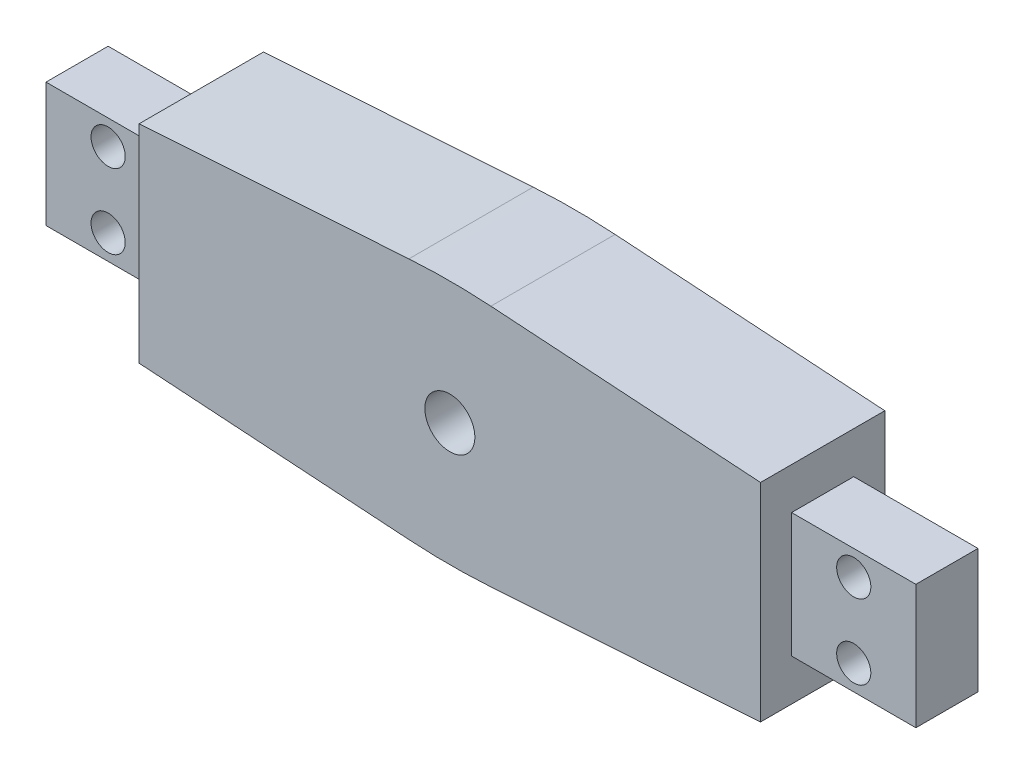
ISO-10303-21;
HEADER;
FILE_DESCRIPTION(('STEP AP214'),'2;1');
FILE_NAME('part.step','',(''),(''),'','','');
FILE_SCHEMA(('AUTOMOTIVE_DESIGN { 1 0 10303 214 1 1 1 1 }'));
ENDSEC;
DATA;
#1=APPLICATION_CONTEXT('core data for automotive mechanical design processes');
#2=APPLICATION_PROTOCOL_DEFINITION('international standard','automotive_design',2000,#1);
#3=PRODUCT_CONTEXT('',#1,'mechanical');
#4=PRODUCT('Part','Part','',(#3));
#5=PRODUCT_RELATED_PRODUCT_CATEGORY('part','',(#4));
#6=PRODUCT_DEFINITION_FORMATION('','',#4);
#7=PRODUCT_DEFINITION_CONTEXT('part definition',#1,'design');
#8=PRODUCT_DEFINITION('design','',#6,#7);
#9=PRODUCT_DEFINITION_SHAPE('','',#8);
#10=(LENGTH_UNIT() NAMED_UNIT(*) SI_UNIT(.MILLI.,.METRE.));
#11=(NAMED_UNIT(*) PLANE_ANGLE_UNIT() SI_UNIT($,.RADIAN.));
#12=(NAMED_UNIT(*) SI_UNIT($,.STERADIAN.) SOLID_ANGLE_UNIT());
#13=UNCERTAINTY_MEASURE_WITH_UNIT(LENGTH_MEASURE(1.E-05),#10,'distance_accuracy_value','');
#14=(GEOMETRIC_REPRESENTATION_CONTEXT(3) GLOBAL_UNCERTAINTY_ASSIGNED_CONTEXT((#13)) GLOBAL_UNIT_ASSIGNED_CONTEXT((#10,
#11,#12)) REPRESENTATION_CONTEXT('',''));
#15=CARTESIAN_POINT('',(0.,0.,0.));
#16=DIRECTION('',(0.,0.,1.));
#17=DIRECTION('',(1.,0.,0.));
#18=AXIS2_PLACEMENT_3D('',#15,#16,#17);
#19=CARTESIAN_POINT('',(-50.,16.6956712271121,20.));
#20=DIRECTION('',(1.,0.,0.));
#21=DIRECTION('',(0.,0.,-1.));
#22=AXIS2_PLACEMENT_3D('',#19,#20,#21);
#23=PLANE('',#22);
#24=DIRECTION('',(0.,-1.,0.));
#25=VECTOR('',#24,1.);
#26=CARTESIAN_POINT('',(-50.,16.6956712271121,0.));
#27=LINE('',#26,#25);
#28=CARTESIAN_POINT('',(-50.,16.6956712271121,0.));
#29=VERTEX_POINT('',#28);
#30=CARTESIAN_POINT('',(-50.,-16.6956712271121,0.));
#31=VERTEX_POINT('',#30);
#32=EDGE_CURVE('E257',#29,#31,#27,.T.);
#33=ORIENTED_EDGE('',*,*,#32,.T.);
#34=DIRECTION('',(0.,0.,-1.));
#35=VECTOR('',#34,1.);
#36=CARTESIAN_POINT('',(-50.,-16.6956712271121,20.));
#37=LINE('',#36,#35);
#38=CARTESIAN_POINT('',(-50.,-16.6956712271121,20.));
#39=VERTEX_POINT('',#38);
#40=EDGE_CURVE('E270',#39,#31,#37,.T.);
#41=ORIENTED_EDGE('',*,*,#40,.F.);
#42=DIRECTION('',(0.,-1.,0.));
#43=VECTOR('',#42,1.);
#44=CARTESIAN_POINT('',(-50.,16.6956712271121,20.));
#45=LINE('',#44,#43);
#46=CARTESIAN_POINT('',(-50.,16.6956712271121,20.));
#47=VERTEX_POINT('',#46);
#48=EDGE_CURVE('E243',#47,#39,#45,.T.);
#49=ORIENTED_EDGE('',*,*,#48,.F.);
#50=DIRECTION('',(0.,0.,-1.));
#51=VECTOR('',#50,1.);
#52=CARTESIAN_POINT('',(-50.,16.6956712271121,20.));
#53=LINE('',#52,#51);
#54=EDGE_CURVE('E273',#47,#29,#53,.T.);
#55=ORIENTED_EDGE('',*,*,#54,.T.);
#56=EDGE_LOOP('',(#33,#41,#49,#55));
#57=FACE_BOUND('',#56,.T.);
#58=DIRECTION('',(0.,-1.,0.));
#59=VECTOR('',#58,1.);
#60=CARTESIAN_POINT('',(-50.,0.,5.));
#61=LINE('',#60,#59);
#62=CARTESIAN_POINT('',(-50.,10.,5.));
#63=VERTEX_POINT('',#62);
#64=CARTESIAN_POINT('',(-50.,-10.,5.));
#65=VERTEX_POINT('',#64);
#66=EDGE_CURVE('E66',#63,#65,#61,.T.);
#67=ORIENTED_EDGE('',*,*,#66,.F.);
#68=DIRECTION('',(0.,0.,-1.));
#69=VECTOR('',#68,1.);
#70=CARTESIAN_POINT('',(-50.,10.,0.));
#71=LINE('',#70,#69);
#72=CARTESIAN_POINT('',(-50.,10.,15.));
#73=VERTEX_POINT('',#72);
#74=EDGE_CURVE('E174',#73,#63,#71,.T.);
#75=ORIENTED_EDGE('',*,*,#74,.F.);
#76=DIRECTION('',(0.,-1.,0.));
#77=VECTOR('',#76,1.);
#78=CARTESIAN_POINT('',(-50.,0.,15.));
#79=LINE('',#78,#77);
#80=CARTESIAN_POINT('',(-50.,-10.,15.));
#81=VERTEX_POINT('',#80);
#82=EDGE_CURVE('E194',#73,#81,#79,.T.);
#83=ORIENTED_EDGE('',*,*,#82,.T.);
#84=DIRECTION('',(0.,0.,-1.));
#85=VECTOR('',#84,1.);
#86=CARTESIAN_POINT('',(-50.,-10.,0.));
#87=LINE('',#86,#85);
#88=EDGE_CURVE('E192',#81,#65,#87,.T.);
#89=ORIENTED_EDGE('',*,*,#88,.T.);
#90=EDGE_LOOP('',(#67,#75,#83,#89));
#91=FACE_BOUND('',#90,.T.);
#92=ADVANCED_FACE('F49',(#57,#91),#23,.F.);
#93=CARTESIAN_POINT('',(0.,0.,20.));
#94=DIRECTION('',(0.,0.,1.));
#95=DIRECTION('',(1.,0.,0.));
#96=AXIS2_PLACEMENT_3D('',#93,#94,#95);
#97=PLANE('',#96);
#98=DIRECTION('',(-0.997823409272585,0.0659427320304099,0.));
#99=VECTOR('',#98,1.);
#100=CARTESIAN_POINT('',(50.,16.6956712271121,20.));
#101=LINE('',#100,#99);
#102=CARTESIAN_POINT('',(50.,16.6956712271121,20.));
#103=VERTEX_POINT('',#102);
#104=CARTESIAN_POINT('',(6.594273203041,19.5642070663782,20.));
#105=VERTEX_POINT('',#104);
#106=EDGE_CURVE('E237',#103,#105,#101,.T.);
#107=ORIENTED_EDGE('',*,*,#106,.T.);
#108=CARTESIAN_POINT('',(0.,-80.2181338608804,20.));
#109=DIRECTION('',(0.,0.,1.));
#110=DIRECTION('',(1.,0.,0.));
#111=AXIS2_PLACEMENT_3D('',#108,#109,#110);
#112=CIRCLE('',#111,100.);
#113=CARTESIAN_POINT('',(-6.59427320304098,19.5642070663782,20.));
#114=VERTEX_POINT('',#113);
#115=EDGE_CURVE('E287',#105,#114,#112,.T.);
#116=ORIENTED_EDGE('',*,*,#115,.T.);
#117=DIRECTION('',(-0.997823409272585,-0.0659427320304099,0.));
#118=VECTOR('',#117,1.);
#119=CARTESIAN_POINT('',(-50.,16.6956712271121,20.));
#120=LINE('',#119,#118);
#121=EDGE_CURVE('E240',#114,#47,#120,.T.);
#122=ORIENTED_EDGE('',*,*,#121,.T.);
#123=ORIENTED_EDGE('',*,*,#48,.T.);
#124=DIRECTION('',(0.997823409272585,-0.0659427320304099,0.));
#125=VECTOR('',#124,1.);
#126=CARTESIAN_POINT('',(0.,-20.,20.));
#127=LINE('',#126,#125);
#128=CARTESIAN_POINT('',(-6.59427320304099,-19.5642070663782,20.));
#129=VERTEX_POINT('',#128);
#130=EDGE_CURVE('E245',#39,#129,#127,.T.);
#131=ORIENTED_EDGE('',*,*,#130,.T.);
#132=CARTESIAN_POINT('',(0.,80.2181338608804,20.));
#133=DIRECTION('',(0.,0.,1.));
#134=DIRECTION('',(1.,0.,0.));
#135=AXIS2_PLACEMENT_3D('',#132,#133,#134);
#136=CIRCLE('',#135,100.);
#137=CARTESIAN_POINT('',(6.59427320304099,-19.5642070663782,20.));
#138=VERTEX_POINT('',#137);
#139=EDGE_CURVE('E285',#129,#138,#136,.T.);
#140=ORIENTED_EDGE('',*,*,#139,.T.);
#141=DIRECTION('',(0.997823409272585,0.0659427320304099,0.));
#142=VECTOR('',#141,1.);
#143=CARTESIAN_POINT('',(0.,-20.,20.));
#144=LINE('',#143,#142);
#145=CARTESIAN_POINT('',(50.,-16.6956712271121,20.));
#146=VERTEX_POINT('',#145);
#147=EDGE_CURVE('E248',#138,#146,#144,.T.);
#148=ORIENTED_EDGE('',*,*,#147,.T.);
#149=DIRECTION('',(0.,1.,0.));
#150=VECTOR('',#149,1.);
#151=CARTESIAN_POINT('',(50.,16.6956712271121,20.));
#152=LINE('',#151,#150);
#153=EDGE_CURVE('E250',#146,#103,#152,.T.);
#154=ORIENTED_EDGE('',*,*,#153,.T.);
#155=EDGE_LOOP('',(#107,#116,#122,#123,#131,#140,#148,#154));
#156=FACE_BOUND('',#155,.T.);
#157=CARTESIAN_POINT('',(0.,0.,20.));
#158=DIRECTION('',(0.,0.,1.));
#159=DIRECTION('',(1.,0.,0.));
#160=AXIS2_PLACEMENT_3D('',#157,#158,#159);
#161=CIRCLE('',#160,4.025);
#162=CARTESIAN_POINT('',(4.025,0.,20.));
#163=VERTEX_POINT('',#162);
#164=EDGE_CURVE('E231',#163,#163,#161,.T.);
#165=ORIENTED_EDGE('',*,*,#164,.F.);
#166=EDGE_LOOP('',(#165));
#167=FACE_BOUND('',#166,.T.);
#168=ADVANCED_FACE('F321',(#156,#167),#97,.T.);
#169=CARTESIAN_POINT('',(0.,0.,0.));
#170=DIRECTION('',(0.,0.,1.));
#171=DIRECTION('',(1.,0.,0.));
#172=AXIS2_PLACEMENT_3D('',#169,#170,#171);
#173=PLANE('',#172);
#174=DIRECTION('',(-0.997823409272585,-0.0659427320304099,0.));
#175=VECTOR('',#174,1.);
#176=CARTESIAN_POINT('',(-50.,16.6956712271121,0.));
#177=LINE('',#176,#175);
#178=CARTESIAN_POINT('',(-6.59427320304098,19.5642070663782,0.));
#179=VERTEX_POINT('',#178);
#180=EDGE_CURVE('E255',#179,#29,#177,.T.);
#181=ORIENTED_EDGE('',*,*,#180,.F.);
#182=CARTESIAN_POINT('',(0.,-80.2181338608804,0.));
#183=DIRECTION('',(0.,0.,1.));
#184=DIRECTION('',(1.,0.,0.));
#185=AXIS2_PLACEMENT_3D('',#182,#183,#184);
#186=CIRCLE('',#185,100.);
#187=CARTESIAN_POINT('',(6.594273203041,19.5642070663782,0.));
#188=VERTEX_POINT('',#187);
#189=EDGE_CURVE('E281',#179,#188,#186,.F.);
#190=ORIENTED_EDGE('',*,*,#189,.T.);
#191=DIRECTION('',(-0.997823409272585,0.0659427320304099,0.));
#192=VECTOR('',#191,1.);
#193=CARTESIAN_POINT('',(50.,16.6956712271121,0.));
#194=LINE('',#193,#192);
#195=CARTESIAN_POINT('',(50.,16.6956712271121,0.));
#196=VERTEX_POINT('',#195);
#197=EDGE_CURVE('E234',#196,#188,#194,.T.);
#198=ORIENTED_EDGE('',*,*,#197,.F.);
#199=DIRECTION('',(0.,1.,0.));
#200=VECTOR('',#199,1.);
#201=CARTESIAN_POINT('',(50.,16.6956712271121,0.));
#202=LINE('',#201,#200);
#203=CARTESIAN_POINT('',(50.,-16.6956712271121,0.));
#204=VERTEX_POINT('',#203);
#205=EDGE_CURVE('E241',#204,#196,#202,.T.);
#206=ORIENTED_EDGE('',*,*,#205,.F.);
#207=DIRECTION('',(0.997823409272585,0.0659427320304099,0.));
#208=VECTOR('',#207,1.);
#209=CARTESIAN_POINT('',(0.,-20.,0.));
#210=LINE('',#209,#208);
#211=CARTESIAN_POINT('',(6.59427320304099,-19.5642070663782,0.));
#212=VERTEX_POINT('',#211);
#213=EDGE_CURVE('E262',#212,#204,#210,.T.);
#214=ORIENTED_EDGE('',*,*,#213,.F.);
#215=CARTESIAN_POINT('',(0.,80.2181338608804,0.));
#216=DIRECTION('',(0.,0.,1.));
#217=DIRECTION('',(1.,0.,0.));
#218=AXIS2_PLACEMENT_3D('',#215,#216,#217);
#219=CIRCLE('',#218,100.);
#220=CARTESIAN_POINT('',(-6.59427320304099,-19.5642070663782,0.));
#221=VERTEX_POINT('',#220);
#222=EDGE_CURVE('E279',#212,#221,#219,.F.);
#223=ORIENTED_EDGE('',*,*,#222,.T.);
#224=DIRECTION('',(0.997823409272585,-0.0659427320304099,0.));
#225=VECTOR('',#224,1.);
#226=CARTESIAN_POINT('',(0.,-20.,0.));
#227=LINE('',#226,#225);
#228=EDGE_CURVE('E259',#31,#221,#227,.T.);
#229=ORIENTED_EDGE('',*,*,#228,.F.);
#230=ORIENTED_EDGE('',*,*,#32,.F.);
#231=EDGE_LOOP('',(#181,#190,#198,#206,#214,#223,#229,#230));
#232=FACE_BOUND('',#231,.T.);
#233=CARTESIAN_POINT('',(0.,0.,0.));
#234=DIRECTION('',(0.,0.,1.));
#235=DIRECTION('',(1.,0.,0.));
#236=AXIS2_PLACEMENT_3D('',#233,#234,#235);
#237=CIRCLE('',#236,4.025);
#238=CARTESIAN_POINT('',(4.025,0.,0.));
#239=VERTEX_POINT('',#238);
#240=EDGE_CURVE('E230',#239,#239,#237,.T.);
#241=ORIENTED_EDGE('',*,*,#240,.T.);
#242=EDGE_LOOP('',(#241));
#243=FACE_BOUND('',#242,.T.);
#244=ADVANCED_FACE('F329',(#232,#243),#173,.F.);
#245=CARTESIAN_POINT('',(50.,16.6956712271121,20.));
#246=DIRECTION('',(-0.0659427320304099,-0.997823409272585,0.));
#247=DIRECTION('',(0.997823409272586,-0.0659427320304099,0.));
#248=AXIS2_PLACEMENT_3D('',#245,#246,#247);
#249=PLANE('',#248);
#250=ORIENTED_EDGE('',*,*,#197,.T.);
#251=DIRECTION('',(0.,0.,-1.));
#252=VECTOR('',#251,1.);
#253=CARTESIAN_POINT('',(6.59427320304098,19.5642070663782,20.));
#254=LINE('',#253,#252);
#255=EDGE_CURVE('E283',#188,#105,#254,.F.);
#256=ORIENTED_EDGE('',*,*,#255,.T.);
#257=ORIENTED_EDGE('',*,*,#106,.F.);
#258=DIRECTION('',(0.,0.,-1.));
#259=VECTOR('',#258,1.);
#260=CARTESIAN_POINT('',(50.,16.6956712271121,20.));
#261=LINE('',#260,#259);
#262=EDGE_CURVE('E252',#103,#196,#261,.T.);
#263=ORIENTED_EDGE('',*,*,#262,.T.);
#264=EDGE_LOOP('',(#250,#256,#257,#263));
#265=FACE_BOUND('',#264,.T.);
#266=ADVANCED_FACE('F340',(#265),#249,.F.);
#267=CARTESIAN_POINT('',(-50.,16.6956712271121,20.));
#268=DIRECTION('',(0.0659427320304099,-0.997823409272585,0.));
#269=DIRECTION('',(0.997823409272586,0.0659427320304099,0.));
#270=AXIS2_PLACEMENT_3D('',#267,#268,#269);
#271=PLANE('',#270);
#272=ORIENTED_EDGE('',*,*,#121,.F.);
#273=DIRECTION('',(0.,0.,-1.));
#274=VECTOR('',#273,1.);
#275=CARTESIAN_POINT('',(-6.59427320304097,19.5642070663782,20.));
#276=LINE('',#275,#274);
#277=EDGE_CURVE('E276',#114,#179,#276,.T.);
#278=ORIENTED_EDGE('',*,*,#277,.T.);
#279=ORIENTED_EDGE('',*,*,#180,.T.);
#280=ORIENTED_EDGE('',*,*,#54,.F.);
#281=EDGE_LOOP('',(#272,#278,#279,#280));
#282=FACE_BOUND('',#281,.T.);
#283=ADVANCED_FACE('F337',(#282),#271,.F.);
#284=CARTESIAN_POINT('',(0.,-20.,20.));
#285=DIRECTION('',(0.0659427320304099,0.997823409272585,0.));
#286=DIRECTION('',(-0.997823409272586,0.0659427320304099,0.));
#287=AXIS2_PLACEMENT_3D('',#284,#285,#286);
#288=PLANE('',#287);
#289=ORIENTED_EDGE('',*,*,#228,.T.);
#290=DIRECTION('',(0.,0.,-1.));
#291=VECTOR('',#290,1.);
#292=CARTESIAN_POINT('',(-6.59427320304099,-19.5642070663782,20.));
#293=LINE('',#292,#291);
#294=EDGE_CURVE('E11',#221,#129,#293,.F.);
#295=ORIENTED_EDGE('',*,*,#294,.T.);
#296=ORIENTED_EDGE('',*,*,#130,.F.);
#297=ORIENTED_EDGE('',*,*,#40,.T.);
#298=EDGE_LOOP('',(#289,#295,#296,#297));
#299=FACE_BOUND('',#298,.T.);
#300=ADVANCED_FACE('F335',(#299),#288,.F.);
#301=CARTESIAN_POINT('',(0.,-20.,20.));
#302=DIRECTION('',(-0.0659427320304099,0.997823409272585,0.));
#303=DIRECTION('',(-0.997823409272586,-0.0659427320304099,0.));
#304=AXIS2_PLACEMENT_3D('',#301,#302,#303);
#305=PLANE('',#304);
#306=ORIENTED_EDGE('',*,*,#147,.F.);
#307=DIRECTION('',(0.,0.,-1.));
#308=VECTOR('',#307,1.);
#309=CARTESIAN_POINT('',(6.59427320304099,-19.5642070663782,20.));
#310=LINE('',#309,#308);
#311=EDGE_CURVE('E58',#138,#212,#310,.T.);
#312=ORIENTED_EDGE('',*,*,#311,.T.);
#313=ORIENTED_EDGE('',*,*,#213,.T.);
#314=DIRECTION('',(0.,0.,-1.));
#315=VECTOR('',#314,1.);
#316=CARTESIAN_POINT('',(50.,-16.6956712271121,20.));
#317=LINE('',#316,#315);
#318=EDGE_CURVE('E267',#146,#204,#317,.T.);
#319=ORIENTED_EDGE('',*,*,#318,.F.);
#320=EDGE_LOOP('',(#306,#312,#313,#319));
#321=FACE_BOUND('',#320,.T.);
#322=ADVANCED_FACE('F377',(#321),#305,.F.);
#323=CARTESIAN_POINT('',(50.,16.6956712271121,20.));
#324=DIRECTION('',(-1.,0.,0.));
#325=DIRECTION('',(0.,0.,1.));
#326=AXIS2_PLACEMENT_3D('',#323,#324,#325);
#327=PLANE('',#326);
#328=DIRECTION('',(0.,0.,-1.));
#329=VECTOR('',#328,1.);
#330=CARTESIAN_POINT('',(50.,10.,0.));
#331=LINE('',#330,#329);
#332=CARTESIAN_POINT('',(50.,10.,15.));
#333=VERTEX_POINT('',#332);
#334=CARTESIAN_POINT('',(50.,10.,5.));
#335=VERTEX_POINT('',#334);
#336=EDGE_CURVE('E215',#333,#335,#331,.T.);
#337=ORIENTED_EDGE('',*,*,#336,.T.);
#338=DIRECTION('',(0.,-1.,0.));
#339=VECTOR('',#338,1.);
#340=CARTESIAN_POINT('',(50.,0.,5.));
#341=LINE('',#340,#339);
#342=CARTESIAN_POINT('',(50.,-10.,5.));
#343=VERTEX_POINT('',#342);
#344=EDGE_CURVE('E74',#335,#343,#341,.T.);
#345=ORIENTED_EDGE('',*,*,#344,.T.);
#346=DIRECTION('',(0.,0.,-1.));
#347=VECTOR('',#346,1.);
#348=CARTESIAN_POINT('',(50.,-10.,0.));
#349=LINE('',#348,#347);
#350=CARTESIAN_POINT('',(50.,-10.,15.));
#351=VERTEX_POINT('',#350);
#352=EDGE_CURVE('E206',#351,#343,#349,.T.);
#353=ORIENTED_EDGE('',*,*,#352,.F.);
#354=DIRECTION('',(0.,-1.,0.));
#355=VECTOR('',#354,1.);
#356=CARTESIAN_POINT('',(50.,0.,15.));
#357=LINE('',#356,#355);
#358=EDGE_CURVE('E218',#333,#351,#357,.T.);
#359=ORIENTED_EDGE('',*,*,#358,.F.);
#360=EDGE_LOOP('',(#337,#345,#353,#359));
#361=FACE_BOUND('',#360,.T.);
#362=ORIENTED_EDGE('',*,*,#205,.T.);
#363=ORIENTED_EDGE('',*,*,#262,.F.);
#364=ORIENTED_EDGE('',*,*,#153,.F.);
#365=ORIENTED_EDGE('',*,*,#318,.T.);
#366=EDGE_LOOP('',(#362,#363,#364,#365));
#367=FACE_BOUND('',#366,.T.);
#368=ADVANCED_FACE('F355',(#361,#367),#327,.F.);
#369=CARTESIAN_POINT('',(0.,0.,20.));
#370=DIRECTION('',(0.,0.,-1.));
#371=DIRECTION('',(-1.,0.,0.));
#372=AXIS2_PLACEMENT_3D('',#369,#370,#371);
#373=CYLINDRICAL_SURFACE('',#372,4.025);
#374=ORIENTED_EDGE('',*,*,#164,.T.);
#375=EDGE_LOOP('',(#374));
#376=FACE_BOUND('',#375,.T.);
#377=ORIENTED_EDGE('',*,*,#240,.F.);
#378=EDGE_LOOP('',(#377));
#379=FACE_BOUND('',#378,.T.);
#380=ADVANCED_FACE('F346',(#376,#379),#373,.F.);
#381=CARTESIAN_POINT('',(0.,-80.2181338608804,20.));
#382=DIRECTION('',(0.,0.,-1.));
#383=DIRECTION('',(-1.,0.,0.));
#384=AXIS2_PLACEMENT_3D('',#381,#382,#383);
#385=CYLINDRICAL_SURFACE('',#384,100.);
#386=ORIENTED_EDGE('',*,*,#115,.F.);
#387=ORIENTED_EDGE('',*,*,#255,.F.);
#388=ORIENTED_EDGE('',*,*,#189,.F.);
#389=ORIENTED_EDGE('',*,*,#277,.F.);
#390=EDGE_LOOP('',(#386,#387,#388,#389));
#391=FACE_BOUND('',#390,.T.);
#392=ADVANCED_FACE('F344',(#391),#385,.T.);
#393=CARTESIAN_POINT('',(0.,80.2181338608804,20.));
#394=DIRECTION('',(0.,0.,-1.));
#395=DIRECTION('',(-1.,0.,0.));
#396=AXIS2_PLACEMENT_3D('',#393,#394,#395);
#397=CYLINDRICAL_SURFACE('',#396,100.);
#398=ORIENTED_EDGE('',*,*,#139,.F.);
#399=ORIENTED_EDGE('',*,*,#294,.F.);
#400=ORIENTED_EDGE('',*,*,#222,.F.);
#401=ORIENTED_EDGE('',*,*,#311,.F.);
#402=EDGE_LOOP('',(#398,#399,#400,#401));
#403=FACE_BOUND('',#402,.T.);
#404=ADVANCED_FACE('F51',(#403),#397,.T.);
#405=CARTESIAN_POINT('',(70.,0.,5.));
#406=DIRECTION('',(0.,0.,-1.));
#407=DIRECTION('',(0.,1.,0.));
#408=AXIS2_PLACEMENT_3D('',#405,#406,#407);
#409=PLANE('',#408);
#410=CARTESIAN_POINT('',(60.,-6.,5.));
#411=DIRECTION('',(0.,0.,-1.));
#412=DIRECTION('',(0.,1.,0.));
#413=AXIS2_PLACEMENT_3D('',#410,#411,#412);
#414=CIRCLE('',#413,2.75000000000003);
#415=CARTESIAN_POINT('',(60.,-3.24999999999997,5.));
#416=VERTEX_POINT('',#415);
#417=EDGE_CURVE('E438',#416,#416,#414,.T.);
#418=ORIENTED_EDGE('',*,*,#417,.F.);
#419=EDGE_LOOP('',(#418));
#420=FACE_BOUND('',#419,.T.);
#421=CARTESIAN_POINT('',(60.,6.,5.));
#422=DIRECTION('',(0.,0.,-1.));
#423=DIRECTION('',(0.,1.,0.));
#424=AXIS2_PLACEMENT_3D('',#421,#422,#423);
#425=CIRCLE('',#424,2.75000000000003);
#426=CARTESIAN_POINT('',(60.,8.75000000000003,5.));
#427=VERTEX_POINT('',#426);
#428=EDGE_CURVE('E441',#427,#427,#425,.T.);
#429=ORIENTED_EDGE('',*,*,#428,.F.);
#430=EDGE_LOOP('',(#429));
#431=FACE_BOUND('',#430,.T.);
#432=ORIENTED_EDGE('',*,*,#344,.F.);
#433=DIRECTION('',(-1.,0.,0.));
#434=VECTOR('',#433,1.);
#435=CARTESIAN_POINT('',(70.,10.,5.));
#436=LINE('',#435,#434);
#437=CARTESIAN_POINT('',(70.,10.,5.));
#438=VERTEX_POINT('',#437);
#439=EDGE_CURVE('E228',#438,#335,#436,.T.);
#440=ORIENTED_EDGE('',*,*,#439,.F.);
#441=DIRECTION('',(0.,-1.,0.));
#442=VECTOR('',#441,1.);
#443=CARTESIAN_POINT('',(70.,0.,5.));
#444=LINE('',#443,#442);
#445=CARTESIAN_POINT('',(70.,-10.,5.));
#446=VERTEX_POINT('',#445);
#447=EDGE_CURVE('E202',#438,#446,#444,.T.);
#448=ORIENTED_EDGE('',*,*,#447,.T.);
#449=DIRECTION('',(-1.,0.,0.));
#450=VECTOR('',#449,1.);
#451=CARTESIAN_POINT('',(70.,-10.,5.));
#452=LINE('',#451,#450);
#453=EDGE_CURVE('E213',#446,#343,#452,.T.);
#454=ORIENTED_EDGE('',*,*,#453,.T.);
#455=EDGE_LOOP('',(#432,#440,#448,#454));
#456=FACE_BOUND('',#455,.T.);
#457=ADVANCED_FACE('F352',(#420,#431,#456),#409,.T.);
#458=CARTESIAN_POINT('',(70.,10.,0.));
#459=DIRECTION('',(0.,1.,0.));
#460=DIRECTION('',(0.,0.,1.));
#461=AXIS2_PLACEMENT_3D('',#458,#459,#460);
#462=PLANE('',#461);
#463=ORIENTED_EDGE('',*,*,#336,.F.);
#464=DIRECTION('',(-1.,0.,0.));
#465=VECTOR('',#464,1.);
#466=CARTESIAN_POINT('',(70.,10.,15.));
#467=LINE('',#466,#465);
#468=CARTESIAN_POINT('',(70.,10.,15.));
#469=VERTEX_POINT('',#468);
#470=EDGE_CURVE('E226',#469,#333,#467,.T.);
#471=ORIENTED_EDGE('',*,*,#470,.F.);
#472=DIRECTION('',(0.,0.,-1.));
#473=VECTOR('',#472,1.);
#474=CARTESIAN_POINT('',(70.,10.,0.));
#475=LINE('',#474,#473);
#476=EDGE_CURVE('E205',#469,#438,#475,.T.);
#477=ORIENTED_EDGE('',*,*,#476,.T.);
#478=ORIENTED_EDGE('',*,*,#439,.T.);
#479=EDGE_LOOP('',(#463,#471,#477,#478));
#480=FACE_BOUND('',#479,.T.);
#481=ADVANCED_FACE('F398',(#480),#462,.T.);
#482=CARTESIAN_POINT('',(70.,0.,15.));
#483=DIRECTION('',(0.,0.,-1.));
#484=DIRECTION('',(0.,1.,0.));
#485=AXIS2_PLACEMENT_3D('',#482,#483,#484);
#486=PLANE('',#485);
#487=CARTESIAN_POINT('',(60.,-6.,15.));
#488=DIRECTION('',(0.,0.,-1.));
#489=DIRECTION('',(0.,1.,0.));
#490=AXIS2_PLACEMENT_3D('',#487,#488,#489);
#491=CIRCLE('',#490,2.75000000000003);
#492=CARTESIAN_POINT('',(60.,-3.24999999999997,15.));
#493=VERTEX_POINT('',#492);
#494=EDGE_CURVE('E53',#493,#493,#491,.T.);
#495=ORIENTED_EDGE('',*,*,#494,.T.);
#496=EDGE_LOOP('',(#495));
#497=FACE_BOUND('',#496,.T.);
#498=CARTESIAN_POINT('',(60.,6.,15.));
#499=DIRECTION('',(0.,0.,-1.));
#500=DIRECTION('',(0.,1.,0.));
#501=AXIS2_PLACEMENT_3D('',#498,#499,#500);
#502=CIRCLE('',#501,2.75000000000003);
#503=CARTESIAN_POINT('',(60.,8.75000000000003,15.));
#504=VERTEX_POINT('',#503);
#505=EDGE_CURVE('E297',#504,#504,#502,.T.);
#506=ORIENTED_EDGE('',*,*,#505,.T.);
#507=EDGE_LOOP('',(#506));
#508=FACE_BOUND('',#507,.T.);
#509=ORIENTED_EDGE('',*,*,#358,.T.);
#510=DIRECTION('',(-1.,0.,0.));
#511=VECTOR('',#510,1.);
#512=CARTESIAN_POINT('',(70.,-10.,15.));
#513=LINE('',#512,#511);
#514=CARTESIAN_POINT('',(70.,-10.,15.));
#515=VERTEX_POINT('',#514);
#516=EDGE_CURVE('E223',#515,#351,#513,.T.);
#517=ORIENTED_EDGE('',*,*,#516,.F.);
#518=DIRECTION('',(0.,-1.,0.));
#519=VECTOR('',#518,1.);
#520=CARTESIAN_POINT('',(70.,0.,15.));
#521=LINE('',#520,#519);
#522=EDGE_CURVE('E209',#469,#515,#521,.T.);
#523=ORIENTED_EDGE('',*,*,#522,.F.);
#524=ORIENTED_EDGE('',*,*,#470,.T.);
#525=EDGE_LOOP('',(#509,#517,#523,#524));
#526=FACE_BOUND('',#525,.T.);
#527=ADVANCED_FACE('F304',(#497,#508,#526),#486,.F.);
#528=CARTESIAN_POINT('',(70.,-10.,0.));
#529=DIRECTION('',(0.,1.,0.));
#530=DIRECTION('',(0.,0.,1.));
#531=AXIS2_PLACEMENT_3D('',#528,#529,#530);
#532=PLANE('',#531);
#533=ORIENTED_EDGE('',*,*,#352,.T.);
#534=ORIENTED_EDGE('',*,*,#453,.F.);
#535=DIRECTION('',(0.,0.,-1.));
#536=VECTOR('',#535,1.);
#537=CARTESIAN_POINT('',(70.,-10.,0.));
#538=LINE('',#537,#536);
#539=EDGE_CURVE('E211',#515,#446,#538,.T.);
#540=ORIENTED_EDGE('',*,*,#539,.F.);
#541=ORIENTED_EDGE('',*,*,#516,.T.);
#542=EDGE_LOOP('',(#533,#534,#540,#541));
#543=FACE_BOUND('',#542,.T.);
#544=ADVANCED_FACE('F404',(#543),#532,.F.);
#545=CARTESIAN_POINT('',(70.,0.,0.));
#546=DIRECTION('',(1.,0.,0.));
#547=DIRECTION('',(0.,0.,-1.));
#548=AXIS2_PLACEMENT_3D('',#545,#546,#547);
#549=PLANE('',#548);
#550=ORIENTED_EDGE('',*,*,#447,.F.);
#551=ORIENTED_EDGE('',*,*,#476,.F.);
#552=ORIENTED_EDGE('',*,*,#522,.T.);
#553=ORIENTED_EDGE('',*,*,#539,.T.);
#554=EDGE_LOOP('',(#550,#551,#552,#553));
#555=FACE_BOUND('',#554,.T.);
#556=ADVANCED_FACE('F407',(#555),#549,.T.);
#557=CARTESIAN_POINT('',(-70.,0.,5.));
#558=DIRECTION('',(0.,0.,1.));
#559=DIRECTION('',(0.,-1.,0.));
#560=AXIS2_PLACEMENT_3D('',#557,#558,#559);
#561=PLANE('',#560);
#562=CARTESIAN_POINT('',(-60.,6.00000000000001,5.));
#563=DIRECTION('',(0.,0.,-1.));
#564=DIRECTION('',(0.,1.,0.));
#565=AXIS2_PLACEMENT_3D('',#562,#563,#564);
#566=CIRCLE('',#565,2.75000000000002);
#567=CARTESIAN_POINT('',(-60.,8.75000000000004,5.));
#568=VERTEX_POINT('',#567);
#569=EDGE_CURVE('E436',#568,#568,#566,.T.);
#570=ORIENTED_EDGE('',*,*,#569,.F.);
#571=EDGE_LOOP('',(#570));
#572=FACE_BOUND('',#571,.T.);
#573=CARTESIAN_POINT('',(-60.,-5.99999999999999,5.));
#574=DIRECTION('',(0.,0.,-1.));
#575=DIRECTION('',(0.,1.,0.));
#576=AXIS2_PLACEMENT_3D('',#573,#574,#575);
#577=CIRCLE('',#576,2.75000000000002);
#578=CARTESIAN_POINT('',(-60.,-3.24999999999996,5.));
#579=VERTEX_POINT('',#578);
#580=EDGE_CURVE('E295',#579,#579,#577,.T.);
#581=ORIENTED_EDGE('',*,*,#580,.F.);
#582=EDGE_LOOP('',(#581));
#583=FACE_BOUND('',#582,.T.);
#584=ORIENTED_EDGE('',*,*,#66,.T.);
#585=DIRECTION('',(1.,0.,0.));
#586=VECTOR('',#585,1.);
#587=CARTESIAN_POINT('',(-70.,-10.,5.));
#588=LINE('',#587,#586);
#589=CARTESIAN_POINT('',(-70.,-10.,5.));
#590=VERTEX_POINT('',#589);
#591=EDGE_CURVE('E176',#590,#65,#588,.T.);
#592=ORIENTED_EDGE('',*,*,#591,.F.);
#593=DIRECTION('',(0.,-1.,0.));
#594=VECTOR('',#593,1.);
#595=CARTESIAN_POINT('',(-70.,0.,5.));
#596=LINE('',#595,#594);
#597=CARTESIAN_POINT('',(-70.,10.,5.));
#598=VERTEX_POINT('',#597);
#599=EDGE_CURVE('E165',#598,#590,#596,.T.);
#600=ORIENTED_EDGE('',*,*,#599,.F.);
#601=DIRECTION('',(1.,0.,0.));
#602=VECTOR('',#601,1.);
#603=CARTESIAN_POINT('',(-70.,10.,5.));
#604=LINE('',#603,#602);
#605=EDGE_CURVE('E190',#598,#63,#604,.T.);
#606=ORIENTED_EDGE('',*,*,#605,.T.);
#607=EDGE_LOOP('',(#584,#592,#600,#606));
#608=FACE_BOUND('',#607,.T.);
#609=ADVANCED_FACE('F177',(#572,#583,#608),#561,.F.);
#610=CARTESIAN_POINT('',(-70.,-10.,0.));
#611=DIRECTION('',(0.,-1.,0.));
#612=DIRECTION('',(0.,0.,-1.));
#613=AXIS2_PLACEMENT_3D('',#610,#611,#612);
#614=PLANE('',#613);
#615=ORIENTED_EDGE('',*,*,#88,.F.);
#616=DIRECTION('',(1.,0.,0.));
#617=VECTOR('',#616,1.);
#618=CARTESIAN_POINT('',(-70.,-10.,15.));
#619=LINE('',#618,#617);
#620=CARTESIAN_POINT('',(-70.,-10.,15.));
#621=VERTEX_POINT('',#620);
#622=EDGE_CURVE('E181',#621,#81,#619,.T.);
#623=ORIENTED_EDGE('',*,*,#622,.F.);
#624=DIRECTION('',(0.,0.,-1.));
#625=VECTOR('',#624,1.);
#626=CARTESIAN_POINT('',(-70.,-10.,0.));
#627=LINE('',#626,#625);
#628=EDGE_CURVE('E169',#621,#590,#627,.T.);
#629=ORIENTED_EDGE('',*,*,#628,.T.);
#630=ORIENTED_EDGE('',*,*,#591,.T.);
#631=EDGE_LOOP('',(#615,#623,#629,#630));
#632=FACE_BOUND('',#631,.T.);
#633=ADVANCED_FACE('F183',(#632),#614,.T.);
#634=CARTESIAN_POINT('',(-70.,0.,15.));
#635=DIRECTION('',(0.,0.,1.));
#636=DIRECTION('',(0.,-1.,0.));
#637=AXIS2_PLACEMENT_3D('',#634,#635,#636);
#638=PLANE('',#637);
#639=CARTESIAN_POINT('',(-60.,6.00000000000001,15.));
#640=DIRECTION('',(0.,0.,1.));
#641=DIRECTION('',(0.,-1.,0.));
#642=AXIS2_PLACEMENT_3D('',#639,#640,#641);
#643=CIRCLE('',#642,2.75000000000002);
#644=CARTESIAN_POINT('',(-60.,3.24999999999999,15.));
#645=VERTEX_POINT('',#644);
#646=EDGE_CURVE('E294',#645,#645,#643,.T.);
#647=ORIENTED_EDGE('',*,*,#646,.F.);
#648=EDGE_LOOP('',(#647));
#649=FACE_BOUND('',#648,.T.);
#650=CARTESIAN_POINT('',(-60.,-5.99999999999999,15.));
#651=DIRECTION('',(0.,0.,1.));
#652=DIRECTION('',(0.,-1.,0.));
#653=AXIS2_PLACEMENT_3D('',#650,#651,#652);
#654=CIRCLE('',#653,2.75000000000002);
#655=CARTESIAN_POINT('',(-60.,-8.75000000000001,15.));
#656=VERTEX_POINT('',#655);
#657=EDGE_CURVE('E291',#656,#656,#654,.T.);
#658=ORIENTED_EDGE('',*,*,#657,.F.);
#659=EDGE_LOOP('',(#658));
#660=FACE_BOUND('',#659,.T.);
#661=ORIENTED_EDGE('',*,*,#82,.F.);
#662=DIRECTION('',(1.,0.,0.));
#663=VECTOR('',#662,1.);
#664=CARTESIAN_POINT('',(-70.,10.,15.));
#665=LINE('',#664,#663);
#666=CARTESIAN_POINT('',(-70.,10.,15.));
#667=VERTEX_POINT('',#666);
#668=EDGE_CURVE('E199',#667,#73,#665,.T.);
#669=ORIENTED_EDGE('',*,*,#668,.F.);
#670=DIRECTION('',(0.,-1.,0.));
#671=VECTOR('',#670,1.);
#672=CARTESIAN_POINT('',(-70.,0.,15.));
#673=LINE('',#672,#671);
#674=EDGE_CURVE('E184',#667,#621,#673,.T.);
#675=ORIENTED_EDGE('',*,*,#674,.T.);
#676=ORIENTED_EDGE('',*,*,#622,.T.);
#677=EDGE_LOOP('',(#661,#669,#675,#676));
#678=FACE_BOUND('',#677,.T.);
#679=ADVANCED_FACE('F415',(#649,#660,#678),#638,.T.);
#680=CARTESIAN_POINT('',(-70.,10.,0.));
#681=DIRECTION('',(0.,-1.,0.));
#682=DIRECTION('',(0.,0.,-1.));
#683=AXIS2_PLACEMENT_3D('',#680,#681,#682);
#684=PLANE('',#683);
#685=ORIENTED_EDGE('',*,*,#74,.T.);
#686=ORIENTED_EDGE('',*,*,#605,.F.);
#687=DIRECTION('',(0.,0.,-1.));
#688=VECTOR('',#687,1.);
#689=CARTESIAN_POINT('',(-70.,10.,0.));
#690=LINE('',#689,#688);
#691=EDGE_CURVE('E172',#667,#598,#690,.T.);
#692=ORIENTED_EDGE('',*,*,#691,.F.);
#693=ORIENTED_EDGE('',*,*,#668,.T.);
#694=EDGE_LOOP('',(#685,#686,#692,#693));
#695=FACE_BOUND('',#694,.T.);
#696=ADVANCED_FACE('F418',(#695),#684,.F.);
#697=CARTESIAN_POINT('',(-70.,0.,0.));
#698=DIRECTION('',(-1.,0.,0.));
#699=DIRECTION('',(0.,0.,-1.));
#700=AXIS2_PLACEMENT_3D('',#697,#698,#699);
#701=PLANE('',#700);
#702=ORIENTED_EDGE('',*,*,#599,.T.);
#703=ORIENTED_EDGE('',*,*,#628,.F.);
#704=ORIENTED_EDGE('',*,*,#674,.F.);
#705=ORIENTED_EDGE('',*,*,#691,.T.);
#706=EDGE_LOOP('',(#702,#703,#704,#705));
#707=FACE_BOUND('',#706,.T.);
#708=ADVANCED_FACE('F166',(#707),#701,.T.);
#709=CARTESIAN_POINT('',(-60.,-5.99999999999999,20.));
#710=DIRECTION('',(0.,0.,-1.));
#711=DIRECTION('',(0.,1.,0.));
#712=AXIS2_PLACEMENT_3D('',#709,#710,#711);
#713=CYLINDRICAL_SURFACE('',#712,2.75000000000002);
#714=ORIENTED_EDGE('',*,*,#657,.T.);
#715=EDGE_LOOP('',(#714));
#716=FACE_BOUND('',#715,.T.);
#717=ORIENTED_EDGE('',*,*,#580,.T.);
#718=EDGE_LOOP('',(#717));
#719=FACE_BOUND('',#718,.T.);
#720=ADVANCED_FACE('F424',(#716,#719),#713,.F.);
#721=CARTESIAN_POINT('',(-60.,6.00000000000001,20.));
#722=DIRECTION('',(0.,0.,-1.));
#723=DIRECTION('',(0.,1.,0.));
#724=AXIS2_PLACEMENT_3D('',#721,#722,#723);
#725=CYLINDRICAL_SURFACE('',#724,2.75000000000002);
#726=ORIENTED_EDGE('',*,*,#646,.T.);
#727=EDGE_LOOP('',(#726));
#728=FACE_BOUND('',#727,.T.);
#729=ORIENTED_EDGE('',*,*,#569,.T.);
#730=EDGE_LOOP('',(#729));
#731=FACE_BOUND('',#730,.T.);
#732=ADVANCED_FACE('F314',(#728,#731),#725,.F.);
#733=CARTESIAN_POINT('',(60.,6.,20.));
#734=DIRECTION('',(0.,0.,-1.));
#735=DIRECTION('',(0.,1.,0.));
#736=AXIS2_PLACEMENT_3D('',#733,#734,#735);
#737=CYLINDRICAL_SURFACE('',#736,2.75000000000003);
#738=ORIENTED_EDGE('',*,*,#428,.T.);
#739=EDGE_LOOP('',(#738));
#740=FACE_BOUND('',#739,.T.);
#741=ORIENTED_EDGE('',*,*,#505,.F.);
#742=EDGE_LOOP('',(#741));
#743=FACE_BOUND('',#742,.T.);
#744=ADVANCED_FACE('F308',(#740,#743),#737,.F.);
#745=CARTESIAN_POINT('',(60.,-6.,20.));
#746=DIRECTION('',(0.,0.,-1.));
#747=DIRECTION('',(0.,1.,0.));
#748=AXIS2_PLACEMENT_3D('',#745,#746,#747);
#749=CYLINDRICAL_SURFACE('',#748,2.75000000000003);
#750=ORIENTED_EDGE('',*,*,#417,.T.);
#751=EDGE_LOOP('',(#750));
#752=FACE_BOUND('',#751,.T.);
#753=ORIENTED_EDGE('',*,*,#494,.F.);
#754=EDGE_LOOP('',(#753));
#755=FACE_BOUND('',#754,.T.);
#756=ADVANCED_FACE('F306',(#752,#755),#749,.F.);
#757=CLOSED_SHELL('',(#92,#168,#244,#266,#283,#300,#322,#368,#380,#392,#404,#457,#481,#527,#544,
#556,#609,#633,#679,#696,#708,#720,#732,#744,#756));
#758=MANIFOLD_SOLID_BREP('B2',#757);
#759=ADVANCED_BREP_SHAPE_REPRESENTATION('',(#18,#758),#14);
#760=SHAPE_DEFINITION_REPRESENTATION(#9,#759);
ENDSEC;
END-ISO-10303-21;
